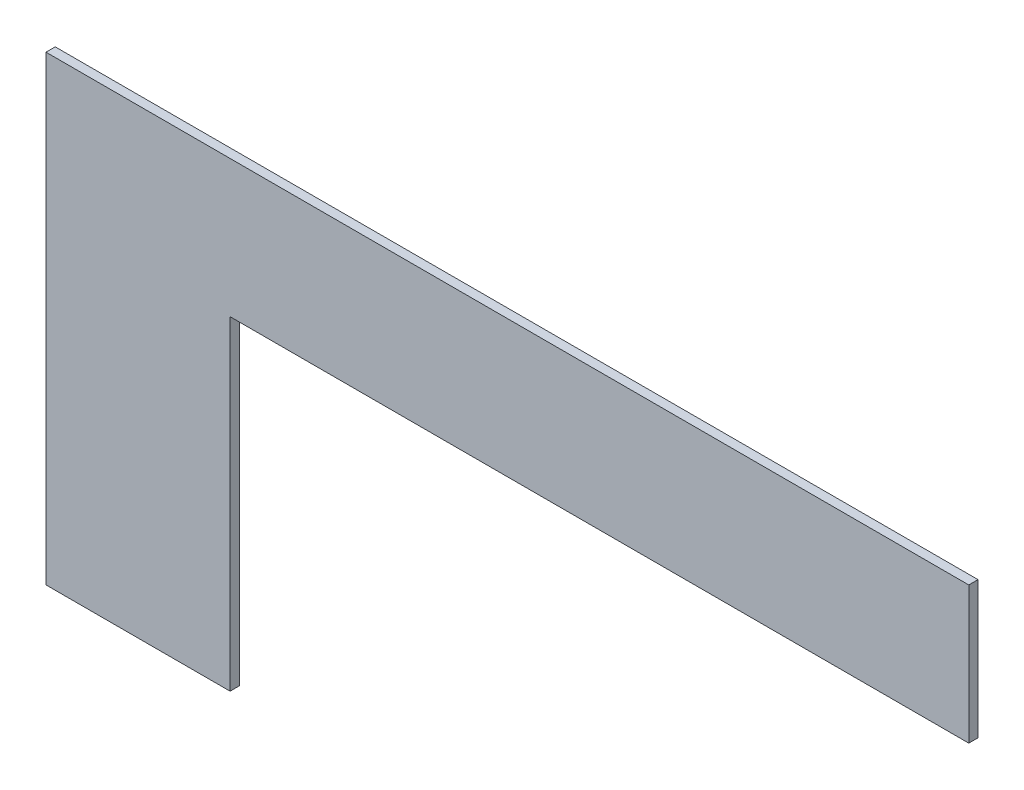
ISO-10303-21;
HEADER;
FILE_DESCRIPTION(('STEP AP214'),'2;1');
FILE_NAME('part.step','',(''),(''),'','','');
FILE_SCHEMA(('AUTOMOTIVE_DESIGN { 1 0 10303 214 1 1 1 1 }'));
ENDSEC;
DATA;
#1=APPLICATION_CONTEXT('core data for automotive mechanical design processes');
#2=APPLICATION_PROTOCOL_DEFINITION('international standard','automotive_design',2000,#1);
#3=PRODUCT_CONTEXT('',#1,'mechanical');
#4=PRODUCT('Part','Part','',(#3));
#5=PRODUCT_RELATED_PRODUCT_CATEGORY('part','',(#4));
#6=PRODUCT_DEFINITION_FORMATION('','',#4);
#7=PRODUCT_DEFINITION_CONTEXT('part definition',#1,'design');
#8=PRODUCT_DEFINITION('design','',#6,#7);
#9=PRODUCT_DEFINITION_SHAPE('','',#8);
#10=(LENGTH_UNIT() NAMED_UNIT(*) SI_UNIT(.MILLI.,.METRE.));
#11=(NAMED_UNIT(*) PLANE_ANGLE_UNIT() SI_UNIT($,.RADIAN.));
#12=(NAMED_UNIT(*) SI_UNIT($,.STERADIAN.) SOLID_ANGLE_UNIT());
#13=UNCERTAINTY_MEASURE_WITH_UNIT(LENGTH_MEASURE(1.E-05),#10,'distance_accuracy_value','');
#14=(GEOMETRIC_REPRESENTATION_CONTEXT(3) GLOBAL_UNCERTAINTY_ASSIGNED_CONTEXT((#13)) GLOBAL_UNIT_ASSIGNED_CONTEXT((#10,
#11,#12)) REPRESENTATION_CONTEXT('',''));
#15=CARTESIAN_POINT('',(0.,0.,0.));
#16=DIRECTION('',(0.,0.,1.));
#17=DIRECTION('',(1.,0.,0.));
#18=AXIS2_PLACEMENT_3D('',#15,#16,#17);
#19=CARTESIAN_POINT('',(0.,0.,-40.));
#20=DIRECTION('',(-1.,0.,0.));
#21=DIRECTION('',(0.,-1.,0.));
#22=AXIS2_PLACEMENT_3D('',#19,#20,#21);
#23=PLANE('',#22);
#24=DIRECTION('',(0.,-1.,0.));
#25=VECTOR('',#24,1.);
#26=CARTESIAN_POINT('',(0.,0.,0.));
#27=LINE('',#26,#25);
#28=CARTESIAN_POINT('',(0.,0.,0.));
#29=VERTEX_POINT('',#28);
#30=CARTESIAN_POINT('',(2.44929359829471E-13,-2000.,0.));
#31=VERTEX_POINT('',#30);
#32=EDGE_CURVE('E124',#29,#31,#27,.T.);
#33=ORIENTED_EDGE('',*,*,#32,.F.);
#34=DIRECTION('',(0.,0.,1.));
#35=VECTOR('',#34,1.);
#36=CARTESIAN_POINT('',(0.,0.,-40.));
#37=LINE('',#36,#35);
#38=CARTESIAN_POINT('',(0.,0.,-40.));
#39=VERTEX_POINT('',#38);
#40=EDGE_CURVE('E54',#39,#29,#37,.T.);
#41=ORIENTED_EDGE('',*,*,#40,.F.);
#42=DIRECTION('',(0.,-1.,0.));
#43=VECTOR('',#42,1.);
#44=CARTESIAN_POINT('',(0.,0.,-40.));
#45=LINE('',#44,#43);
#46=CARTESIAN_POINT('',(2.44929359829471E-13,-2000.,-40.));
#47=VERTEX_POINT('',#46);
#48=EDGE_CURVE('E125',#39,#47,#45,.T.);
#49=ORIENTED_EDGE('',*,*,#48,.T.);
#50=DIRECTION('',(0.,0.,1.));
#51=VECTOR('',#50,1.);
#52=CARTESIAN_POINT('',(2.44929359829471E-13,-2000.,-40.));
#53=LINE('',#52,#51);
#54=EDGE_CURVE('E79',#47,#31,#53,.T.);
#55=ORIENTED_EDGE('',*,*,#54,.T.);
#56=EDGE_LOOP('',(#33,#41,#49,#55));
#57=FACE_BOUND('',#56,.T.);
#58=ADVANCED_FACE('F38',(#57),#23,.T.);
#59=CARTESIAN_POINT('',(0.,0.,-40.));
#60=DIRECTION('',(0.,1.,0.));
#61=DIRECTION('',(0.,0.,1.));
#62=AXIS2_PLACEMENT_3D('',#59,#60,#61);
#63=PLANE('',#62);
#64=DIRECTION('',(-1.,0.,0.));
#65=VECTOR('',#64,1.);
#66=CARTESIAN_POINT('',(0.,0.,0.));
#67=LINE('',#66,#65);
#68=CARTESIAN_POINT('',(4000.,0.,0.));
#69=VERTEX_POINT('',#68);
#70=EDGE_CURVE('E128',#69,#29,#67,.T.);
#71=ORIENTED_EDGE('',*,*,#70,.F.);
#72=DIRECTION('',(0.,0.,1.));
#73=VECTOR('',#72,1.);
#74=CARTESIAN_POINT('',(4000.,0.,-40.));
#75=LINE('',#74,#73);
#76=CARTESIAN_POINT('',(4000.,0.,-40.));
#77=VERTEX_POINT('',#76);
#78=EDGE_CURVE('E141',#77,#69,#75,.T.);
#79=ORIENTED_EDGE('',*,*,#78,.F.);
#80=DIRECTION('',(-1.,0.,0.));
#81=VECTOR('',#80,1.);
#82=CARTESIAN_POINT('',(0.,0.,-40.));
#83=LINE('',#82,#81);
#84=EDGE_CURVE('E131',#77,#39,#83,.T.);
#85=ORIENTED_EDGE('',*,*,#84,.T.);
#86=ORIENTED_EDGE('',*,*,#40,.T.);
#87=EDGE_LOOP('',(#71,#79,#85,#86));
#88=FACE_BOUND('',#87,.T.);
#89=ADVANCED_FACE('F146',(#88),#63,.T.);
#90=CARTESIAN_POINT('',(4000.,0.,-40.));
#91=DIRECTION('',(1.,0.,0.));
#92=DIRECTION('',(0.,0.,-1.));
#93=AXIS2_PLACEMENT_3D('',#90,#91,#92);
#94=PLANE('',#93);
#95=DIRECTION('',(0.,0.,1.));
#96=VECTOR('',#95,1.);
#97=CARTESIAN_POINT('',(4000.,-594.,-40.));
#98=LINE('',#97,#96);
#99=CARTESIAN_POINT('',(4000.,-594.,-40.));
#100=VERTEX_POINT('',#99);
#101=CARTESIAN_POINT('',(4000.,-594.,0.));
#102=VERTEX_POINT('',#101);
#103=EDGE_CURVE('E109',#100,#102,#98,.T.);
#104=ORIENTED_EDGE('',*,*,#103,.F.);
#105=DIRECTION('',(0.,1.,0.));
#106=VECTOR('',#105,1.);
#107=CARTESIAN_POINT('',(4000.,0.,-40.));
#108=LINE('',#107,#106);
#109=EDGE_CURVE('E106',#100,#77,#108,.T.);
#110=ORIENTED_EDGE('',*,*,#109,.T.);
#111=ORIENTED_EDGE('',*,*,#78,.T.);
#112=DIRECTION('',(0.,1.,0.));
#113=VECTOR('',#112,1.);
#114=CARTESIAN_POINT('',(4000.,0.,0.));
#115=LINE('',#114,#113);
#116=EDGE_CURVE('E70',#102,#69,#115,.T.);
#117=ORIENTED_EDGE('',*,*,#116,.F.);
#118=EDGE_LOOP('',(#104,#110,#111,#117));
#119=FACE_BOUND('',#118,.T.);
#120=ADVANCED_FACE('F148',(#119),#94,.T.);
#121=CARTESIAN_POINT('',(2.44929359829471E-13,-2000.,-40.));
#122=DIRECTION('',(0.,-1.,0.));
#123=DIRECTION('',(1.,0.,0.));
#124=AXIS2_PLACEMENT_3D('',#121,#122,#123);
#125=PLANE('',#124);
#126=DIRECTION('',(0.,0.,1.));
#127=VECTOR('',#126,1.);
#128=CARTESIAN_POINT('',(798.,-2000.,-40.));
#129=LINE('',#128,#127);
#130=CARTESIAN_POINT('',(798.,-2000.,-40.));
#131=VERTEX_POINT('',#130);
#132=CARTESIAN_POINT('',(798.,-2000.,0.));
#133=VERTEX_POINT('',#132);
#134=EDGE_CURVE('E110',#131,#133,#129,.T.);
#135=ORIENTED_EDGE('',*,*,#134,.T.);
#136=DIRECTION('',(1.,0.,0.));
#137=VECTOR('',#136,1.);
#138=CARTESIAN_POINT('',(2.44929359829471E-13,-2000.,0.));
#139=LINE('',#138,#137);
#140=EDGE_CURVE('E135',#31,#133,#139,.T.);
#141=ORIENTED_EDGE('',*,*,#140,.F.);
#142=ORIENTED_EDGE('',*,*,#54,.F.);
#143=DIRECTION('',(1.,0.,0.));
#144=VECTOR('',#143,1.);
#145=CARTESIAN_POINT('',(2.44929359829471E-13,-2000.,-40.));
#146=LINE('',#145,#144);
#147=EDGE_CURVE('E127',#47,#131,#146,.T.);
#148=ORIENTED_EDGE('',*,*,#147,.T.);
#149=EDGE_LOOP('',(#135,#141,#142,#148));
#150=FACE_BOUND('',#149,.T.);
#151=ADVANCED_FACE('F143',(#150),#125,.T.);
#152=CARTESIAN_POINT('',(0.,0.,-40.));
#153=DIRECTION('',(0.,0.,1.));
#154=DIRECTION('',(1.,0.,0.));
#155=AXIS2_PLACEMENT_3D('',#152,#153,#154);
#156=PLANE('',#155);
#157=DIRECTION('',(-1.,0.,0.));
#158=VECTOR('',#157,1.);
#159=CARTESIAN_POINT('',(800.,-594.,-40.));
#160=LINE('',#159,#158);
#161=CARTESIAN_POINT('',(798.,-594.,-40.));
#162=VERTEX_POINT('',#161);
#163=EDGE_CURVE('E100',#100,#162,#160,.T.);
#164=ORIENTED_EDGE('',*,*,#163,.T.);
#165=DIRECTION('',(0.,-1.,0.));
#166=VECTOR('',#165,1.);
#167=CARTESIAN_POINT('',(798.,-2000.,-40.));
#168=LINE('',#167,#166);
#169=EDGE_CURVE('E104',#162,#131,#168,.T.);
#170=ORIENTED_EDGE('',*,*,#169,.T.);
#171=ORIENTED_EDGE('',*,*,#147,.F.);
#172=ORIENTED_EDGE('',*,*,#48,.F.);
#173=ORIENTED_EDGE('',*,*,#84,.F.);
#174=ORIENTED_EDGE('',*,*,#109,.F.);
#175=EDGE_LOOP('',(#164,#170,#171,#172,#173,#174));
#176=FACE_BOUND('',#175,.T.);
#177=ADVANCED_FACE('F102',(#176),#156,.F.);
#178=CARTESIAN_POINT('',(0.,0.,0.));
#179=DIRECTION('',(0.,0.,1.));
#180=DIRECTION('',(1.,0.,0.));
#181=AXIS2_PLACEMENT_3D('',#178,#179,#180);
#182=PLANE('',#181);
#183=DIRECTION('',(0.,-1.,0.));
#184=VECTOR('',#183,1.);
#185=CARTESIAN_POINT('',(798.,0.,0.));
#186=LINE('',#185,#184);
#187=CARTESIAN_POINT('',(798.,-594.,0.));
#188=VERTEX_POINT('',#187);
#189=EDGE_CURVE('E11',#188,#133,#186,.T.);
#190=ORIENTED_EDGE('',*,*,#189,.F.);
#191=DIRECTION('',(-1.,0.,0.));
#192=VECTOR('',#191,1.);
#193=CARTESIAN_POINT('',(0.,-594.,0.));
#194=LINE('',#193,#192);
#195=EDGE_CURVE('E46',#102,#188,#194,.T.);
#196=ORIENTED_EDGE('',*,*,#195,.F.);
#197=ORIENTED_EDGE('',*,*,#116,.T.);
#198=ORIENTED_EDGE('',*,*,#70,.T.);
#199=ORIENTED_EDGE('',*,*,#32,.T.);
#200=ORIENTED_EDGE('',*,*,#140,.T.);
#201=EDGE_LOOP('',(#190,#196,#197,#198,#199,#200));
#202=FACE_BOUND('',#201,.T.);
#203=ADVANCED_FACE('F144',(#202),#182,.T.);
#204=CARTESIAN_POINT('',(800.,-594.,-40.));
#205=DIRECTION('',(0.,1.,0.));
#206=DIRECTION('',(0.,0.,1.));
#207=AXIS2_PLACEMENT_3D('',#204,#205,#206);
#208=PLANE('',#207);
#209=ORIENTED_EDGE('',*,*,#195,.T.);
#210=DIRECTION('',(0.,0.,1.));
#211=VECTOR('',#210,1.);
#212=CARTESIAN_POINT('',(798.,-594.,-40.));
#213=LINE('',#212,#211);
#214=EDGE_CURVE('E113',#162,#188,#213,.T.);
#215=ORIENTED_EDGE('',*,*,#214,.F.);
#216=ORIENTED_EDGE('',*,*,#163,.F.);
#217=ORIENTED_EDGE('',*,*,#103,.T.);
#218=EDGE_LOOP('',(#209,#215,#216,#217));
#219=FACE_BOUND('',#218,.T.);
#220=ADVANCED_FACE('F114',(#219),#208,.F.);
#221=CARTESIAN_POINT('',(798.,-2000.,-40.));
#222=DIRECTION('',(-1.,0.,0.));
#223=DIRECTION('',(0.,0.,1.));
#224=AXIS2_PLACEMENT_3D('',#221,#222,#223);
#225=PLANE('',#224);
#226=ORIENTED_EDGE('',*,*,#189,.T.);
#227=ORIENTED_EDGE('',*,*,#134,.F.);
#228=ORIENTED_EDGE('',*,*,#169,.F.);
#229=ORIENTED_EDGE('',*,*,#214,.T.);
#230=EDGE_LOOP('',(#226,#227,#228,#229));
#231=FACE_BOUND('',#230,.T.);
#232=ADVANCED_FACE('F118',(#231),#225,.F.);
#233=CLOSED_SHELL('',(#58,#89,#120,#151,#177,#203,#220,#232));
#234=MANIFOLD_SOLID_BREP('B2',#233);
#235=ADVANCED_BREP_SHAPE_REPRESENTATION('',(#18,#234),#14);
#236=SHAPE_DEFINITION_REPRESENTATION(#9,#235);
ENDSEC;
END-ISO-10303-21;
